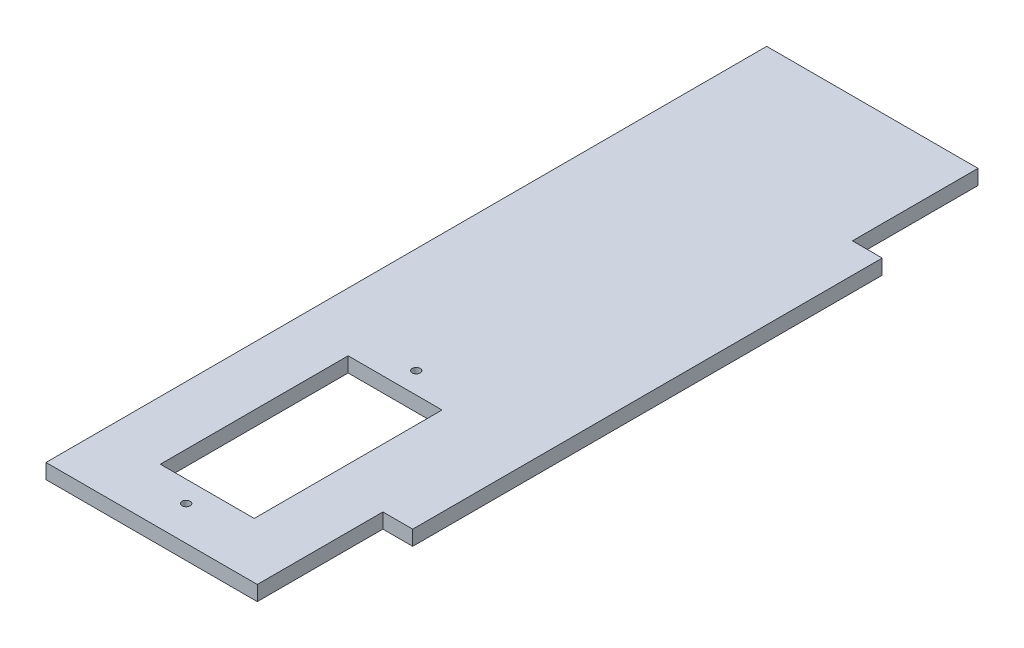
ISO-10303-21;
HEADER;
FILE_DESCRIPTION(('STEP AP214'),'2;1');
FILE_NAME('part.step','',(''),(''),'','','');
FILE_SCHEMA(('AUTOMOTIVE_DESIGN { 1 0 10303 214 1 1 1 1 }'));
ENDSEC;
DATA;
#1=APPLICATION_CONTEXT('core data for automotive mechanical design processes');
#2=APPLICATION_PROTOCOL_DEFINITION('international standard','automotive_design',2000,#1);
#3=PRODUCT_CONTEXT('',#1,'mechanical');
#4=PRODUCT('Part','Part','',(#3));
#5=PRODUCT_RELATED_PRODUCT_CATEGORY('part','',(#4));
#6=PRODUCT_DEFINITION_FORMATION('','',#4);
#7=PRODUCT_DEFINITION_CONTEXT('part definition',#1,'design');
#8=PRODUCT_DEFINITION('design','',#6,#7);
#9=PRODUCT_DEFINITION_SHAPE('','',#8);
#10=(LENGTH_UNIT() NAMED_UNIT(*) SI_UNIT(.MILLI.,.METRE.));
#11=(NAMED_UNIT(*) PLANE_ANGLE_UNIT() SI_UNIT($,.RADIAN.));
#12=(NAMED_UNIT(*) SI_UNIT($,.STERADIAN.) SOLID_ANGLE_UNIT());
#13=UNCERTAINTY_MEASURE_WITH_UNIT(LENGTH_MEASURE(1.E-05),#10,'distance_accuracy_value','');
#14=(GEOMETRIC_REPRESENTATION_CONTEXT(3) GLOBAL_UNCERTAINTY_ASSIGNED_CONTEXT((#13)) GLOBAL_UNIT_ASSIGNED_CONTEXT((#10,
#11,#12)) REPRESENTATION_CONTEXT('',''));
#15=CARTESIAN_POINT('',(0.,0.,0.));
#16=DIRECTION('',(0.,0.,1.));
#17=DIRECTION('',(1.,0.,0.));
#18=AXIS2_PLACEMENT_3D('',#15,#16,#17);
#19=CARTESIAN_POINT('',(-22.5,3.175,0.));
#20=DIRECTION('',(-1.,0.,0.));
#21=DIRECTION('',(0.,0.,1.));
#22=AXIS2_PLACEMENT_3D('',#19,#20,#21);
#23=PLANE('',#22);
#24=DIRECTION('',(0.,0.,-1.));
#25=VECTOR('',#24,1.);
#26=CARTESIAN_POINT('',(-22.5,0.,0.));
#27=LINE('',#26,#25);
#28=CARTESIAN_POINT('',(-22.5,0.,126.75));
#29=VERTEX_POINT('',#28);
#30=CARTESIAN_POINT('',(-22.5,0.,-26.75));
#31=VERTEX_POINT('',#30);
#32=EDGE_CURVE('E158',#29,#31,#27,.T.);
#33=ORIENTED_EDGE('',*,*,#32,.F.);
#34=DIRECTION('',(0.,-1.,0.));
#35=VECTOR('',#34,1.);
#36=CARTESIAN_POINT('',(-22.5,3.175,126.75));
#37=LINE('',#36,#35);
#38=CARTESIAN_POINT('',(-22.5,3.175,126.75));
#39=VERTEX_POINT('',#38);
#40=EDGE_CURVE('E11',#39,#29,#37,.T.);
#41=ORIENTED_EDGE('',*,*,#40,.F.);
#42=DIRECTION('',(0.,0.,-1.));
#43=VECTOR('',#42,1.);
#44=CARTESIAN_POINT('',(-22.5,3.175,0.));
#45=LINE('',#44,#43);
#46=CARTESIAN_POINT('',(-22.5,3.175,-26.75));
#47=VERTEX_POINT('',#46);
#48=EDGE_CURVE('E162',#39,#47,#45,.T.);
#49=ORIENTED_EDGE('',*,*,#48,.T.);
#50=DIRECTION('',(0.,-1.,0.));
#51=VECTOR('',#50,1.);
#52=CARTESIAN_POINT('',(-22.5,3.175,-26.75));
#53=LINE('',#52,#51);
#54=EDGE_CURVE('E187',#47,#31,#53,.T.);
#55=ORIENTED_EDGE('',*,*,#54,.T.);
#56=EDGE_LOOP('',(#33,#41,#49,#55));
#57=FACE_BOUND('',#56,.T.);
#58=ADVANCED_FACE('F35',(#57),#23,.T.);
#59=CARTESIAN_POINT('',(0.,3.175,126.75));
#60=DIRECTION('',(0.,0.,1.));
#61=DIRECTION('',(1.,0.,0.));
#62=AXIS2_PLACEMENT_3D('',#59,#60,#61);
#63=PLANE('',#62);
#64=DIRECTION('',(-1.,0.,0.));
#65=VECTOR('',#64,1.);
#66=CARTESIAN_POINT('',(0.,0.,126.75));
#67=LINE('',#66,#65);
#68=CARTESIAN_POINT('',(22.5,0.,126.75));
#69=VERTEX_POINT('',#68);
#70=EDGE_CURVE('E190',#69,#29,#67,.T.);
#71=ORIENTED_EDGE('',*,*,#70,.F.);
#72=DIRECTION('',(0.,-1.,0.));
#73=VECTOR('',#72,1.);
#74=CARTESIAN_POINT('',(22.5,3.175,126.75));
#75=LINE('',#74,#73);
#76=CARTESIAN_POINT('',(22.5,3.175,126.75));
#77=VERTEX_POINT('',#76);
#78=EDGE_CURVE('E42',#77,#69,#75,.T.);
#79=ORIENTED_EDGE('',*,*,#78,.F.);
#80=DIRECTION('',(-1.,0.,0.));
#81=VECTOR('',#80,1.);
#82=CARTESIAN_POINT('',(0.,3.175,126.75));
#83=LINE('',#82,#81);
#84=EDGE_CURVE('E165',#77,#39,#83,.T.);
#85=ORIENTED_EDGE('',*,*,#84,.T.);
#86=ORIENTED_EDGE('',*,*,#40,.T.);
#87=EDGE_LOOP('',(#71,#79,#85,#86));
#88=FACE_BOUND('',#87,.T.);
#89=ADVANCED_FACE('F227',(#88),#63,.T.);
#90=CARTESIAN_POINT('',(22.5,3.175,0.));
#91=DIRECTION('',(1.,0.,0.));
#92=DIRECTION('',(0.,0.,-1.));
#93=AXIS2_PLACEMENT_3D('',#90,#91,#92);
#94=PLANE('',#93);
#95=DIRECTION('',(0.,0.,1.));
#96=VECTOR('',#95,1.);
#97=CARTESIAN_POINT('',(22.5,0.,0.));
#98=LINE('',#97,#96);
#99=CARTESIAN_POINT('',(22.5,0.,100.));
#100=VERTEX_POINT('',#99);
#101=EDGE_CURVE('E193',#100,#69,#98,.T.);
#102=ORIENTED_EDGE('',*,*,#101,.F.);
#103=DIRECTION('',(0.,-1.,0.));
#104=VECTOR('',#103,1.);
#105=CARTESIAN_POINT('',(22.5,3.175,100.));
#106=LINE('',#105,#104);
#107=CARTESIAN_POINT('',(22.5,3.175,100.));
#108=VERTEX_POINT('',#107);
#109=EDGE_CURVE('E219',#108,#100,#106,.T.);
#110=ORIENTED_EDGE('',*,*,#109,.F.);
#111=DIRECTION('',(0.,0.,1.));
#112=VECTOR('',#111,1.);
#113=CARTESIAN_POINT('',(22.5,3.175,0.));
#114=LINE('',#113,#112);
#115=EDGE_CURVE('E169',#108,#77,#114,.T.);
#116=ORIENTED_EDGE('',*,*,#115,.T.);
#117=ORIENTED_EDGE('',*,*,#78,.T.);
#118=EDGE_LOOP('',(#102,#110,#116,#117));
#119=FACE_BOUND('',#118,.T.);
#120=ADVANCED_FACE('F223',(#119),#94,.T.);
#121=CARTESIAN_POINT('',(0.,3.175,100.));
#122=DIRECTION('',(0.,0.,1.));
#123=DIRECTION('',(1.,0.,0.));
#124=AXIS2_PLACEMENT_3D('',#121,#122,#123);
#125=PLANE('',#124);
#126=DIRECTION('',(-1.,0.,0.));
#127=VECTOR('',#126,1.);
#128=CARTESIAN_POINT('',(0.,0.,100.));
#129=LINE('',#128,#127);
#130=CARTESIAN_POINT('',(28.85,0.,100.));
#131=VERTEX_POINT('',#130);
#132=EDGE_CURVE('E196',#131,#100,#129,.T.);
#133=ORIENTED_EDGE('',*,*,#132,.F.);
#134=DIRECTION('',(0.,-1.,0.));
#135=VECTOR('',#134,1.);
#136=CARTESIAN_POINT('',(28.85,3.175,100.));
#137=LINE('',#136,#135);
#138=CARTESIAN_POINT('',(28.85,3.175,100.));
#139=VERTEX_POINT('',#138);
#140=EDGE_CURVE('E217',#139,#131,#137,.T.);
#141=ORIENTED_EDGE('',*,*,#140,.F.);
#142=DIRECTION('',(-1.,0.,0.));
#143=VECTOR('',#142,1.);
#144=CARTESIAN_POINT('',(0.,3.175,100.));
#145=LINE('',#144,#143);
#146=EDGE_CURVE('E172',#139,#108,#145,.T.);
#147=ORIENTED_EDGE('',*,*,#146,.T.);
#148=ORIENTED_EDGE('',*,*,#109,.T.);
#149=EDGE_LOOP('',(#133,#141,#147,#148));
#150=FACE_BOUND('',#149,.T.);
#151=ADVANCED_FACE('F232',(#150),#125,.T.);
#152=CARTESIAN_POINT('',(28.85,3.175,0.));
#153=DIRECTION('',(1.,0.,0.));
#154=DIRECTION('',(0.,0.,-1.));
#155=AXIS2_PLACEMENT_3D('',#152,#153,#154);
#156=PLANE('',#155);
#157=DIRECTION('',(0.,0.,1.));
#158=VECTOR('',#157,1.);
#159=CARTESIAN_POINT('',(28.85,0.,0.));
#160=LINE('',#159,#158);
#161=CARTESIAN_POINT('',(28.85,0.,0.));
#162=VERTEX_POINT('',#161);
#163=EDGE_CURVE('E199',#162,#131,#160,.T.);
#164=ORIENTED_EDGE('',*,*,#163,.F.);
#165=DIRECTION('',(0.,-1.,0.));
#166=VECTOR('',#165,1.);
#167=CARTESIAN_POINT('',(28.85,3.175,0.));
#168=LINE('',#167,#166);
#169=CARTESIAN_POINT('',(28.85,3.175,0.));
#170=VERTEX_POINT('',#169);
#171=EDGE_CURVE('E215',#170,#162,#168,.T.);
#172=ORIENTED_EDGE('',*,*,#171,.F.);
#173=DIRECTION('',(0.,0.,1.));
#174=VECTOR('',#173,1.);
#175=CARTESIAN_POINT('',(28.85,3.175,0.));
#176=LINE('',#175,#174);
#177=EDGE_CURVE('E175',#170,#139,#176,.T.);
#178=ORIENTED_EDGE('',*,*,#177,.T.);
#179=ORIENTED_EDGE('',*,*,#140,.T.);
#180=EDGE_LOOP('',(#164,#172,#178,#179));
#181=FACE_BOUND('',#180,.T.);
#182=ADVANCED_FACE('F252',(#181),#156,.T.);
#183=CARTESIAN_POINT('',(0.,3.175,0.));
#184=DIRECTION('',(0.,0.,-1.));
#185=DIRECTION('',(-1.,0.,0.));
#186=AXIS2_PLACEMENT_3D('',#183,#184,#185);
#187=PLANE('',#186);
#188=DIRECTION('',(1.,0.,0.));
#189=VECTOR('',#188,1.);
#190=CARTESIAN_POINT('',(0.,0.,0.));
#191=LINE('',#190,#189);
#192=CARTESIAN_POINT('',(22.5,0.,0.));
#193=VERTEX_POINT('',#192);
#194=EDGE_CURVE('E202',#193,#162,#191,.T.);
#195=ORIENTED_EDGE('',*,*,#194,.F.);
#196=DIRECTION('',(0.,-1.,0.));
#197=VECTOR('',#196,1.);
#198=CARTESIAN_POINT('',(22.5,3.175,0.));
#199=LINE('',#198,#197);
#200=CARTESIAN_POINT('',(22.5,3.175,0.));
#201=VERTEX_POINT('',#200);
#202=EDGE_CURVE('E213',#201,#193,#199,.T.);
#203=ORIENTED_EDGE('',*,*,#202,.F.);
#204=DIRECTION('',(1.,0.,0.));
#205=VECTOR('',#204,1.);
#206=CARTESIAN_POINT('',(0.,3.175,0.));
#207=LINE('',#206,#205);
#208=EDGE_CURVE('E178',#201,#170,#207,.T.);
#209=ORIENTED_EDGE('',*,*,#208,.T.);
#210=ORIENTED_EDGE('',*,*,#171,.T.);
#211=EDGE_LOOP('',(#195,#203,#209,#210));
#212=FACE_BOUND('',#211,.T.);
#213=ADVANCED_FACE('F249',(#212),#187,.T.);
#214=CARTESIAN_POINT('',(22.5,3.175,0.));
#215=DIRECTION('',(1.,0.,0.));
#216=DIRECTION('',(0.,0.,-1.));
#217=AXIS2_PLACEMENT_3D('',#214,#215,#216);
#218=PLANE('',#217);
#219=DIRECTION('',(0.,0.,1.));
#220=VECTOR('',#219,1.);
#221=CARTESIAN_POINT('',(22.5,0.,0.));
#222=LINE('',#221,#220);
#223=CARTESIAN_POINT('',(22.5,0.,-26.75));
#224=VERTEX_POINT('',#223);
#225=EDGE_CURVE('E205',#224,#193,#222,.T.);
#226=ORIENTED_EDGE('',*,*,#225,.F.);
#227=DIRECTION('',(0.,-1.,0.));
#228=VECTOR('',#227,1.);
#229=CARTESIAN_POINT('',(22.5,3.175,-26.75));
#230=LINE('',#229,#228);
#231=CARTESIAN_POINT('',(22.5,3.175,-26.75));
#232=VERTEX_POINT('',#231);
#233=EDGE_CURVE('E211',#232,#224,#230,.T.);
#234=ORIENTED_EDGE('',*,*,#233,.F.);
#235=DIRECTION('',(0.,0.,1.));
#236=VECTOR('',#235,1.);
#237=CARTESIAN_POINT('',(22.5,3.175,0.));
#238=LINE('',#237,#236);
#239=EDGE_CURVE('E181',#232,#201,#238,.T.);
#240=ORIENTED_EDGE('',*,*,#239,.T.);
#241=ORIENTED_EDGE('',*,*,#202,.T.);
#242=EDGE_LOOP('',(#226,#234,#240,#241));
#243=FACE_BOUND('',#242,.T.);
#244=ADVANCED_FACE('F246',(#243),#218,.T.);
#245=CARTESIAN_POINT('',(0.,3.175,-26.75));
#246=DIRECTION('',(0.,0.,-1.));
#247=DIRECTION('',(-1.,0.,0.));
#248=AXIS2_PLACEMENT_3D('',#245,#246,#247);
#249=PLANE('',#248);
#250=DIRECTION('',(1.,0.,0.));
#251=VECTOR('',#250,1.);
#252=CARTESIAN_POINT('',(0.,0.,-26.75));
#253=LINE('',#252,#251);
#254=EDGE_CURVE('E166',#31,#224,#253,.T.);
#255=ORIENTED_EDGE('',*,*,#254,.F.);
#256=ORIENTED_EDGE('',*,*,#54,.F.);
#257=DIRECTION('',(1.,0.,0.));
#258=VECTOR('',#257,1.);
#259=CARTESIAN_POINT('',(0.,3.175,-26.75));
#260=LINE('',#259,#258);
#261=EDGE_CURVE('E184',#47,#232,#260,.T.);
#262=ORIENTED_EDGE('',*,*,#261,.T.);
#263=ORIENTED_EDGE('',*,*,#233,.T.);
#264=EDGE_LOOP('',(#255,#256,#262,#263));
#265=FACE_BOUND('',#264,.T.);
#266=ADVANCED_FACE('F243',(#265),#249,.T.);
#267=CARTESIAN_POINT('',(0.,3.175,0.));
#268=DIRECTION('',(0.,1.,0.));
#269=DIRECTION('',(0.,0.,1.));
#270=AXIS2_PLACEMENT_3D('',#267,#268,#269);
#271=PLANE('',#270);
#272=CARTESIAN_POINT('',(0.,3.175,70.4));
#273=DIRECTION('',(0.,1.,0.));
#274=DIRECTION('',(0.,0.,1.));
#275=AXIS2_PLACEMENT_3D('',#272,#273,#274);
#276=CIRCLE('',#275,0.849999999999988);
#277=CARTESIAN_POINT('',(0.,3.175,71.25));
#278=VERTEX_POINT('',#277);
#279=EDGE_CURVE('E384',#278,#278,#276,.T.);
#280=ORIENTED_EDGE('',*,*,#279,.F.);
#281=EDGE_LOOP('',(#280));
#282=FACE_BOUND('',#281,.T.);
#283=CARTESIAN_POINT('',(0.,3.175,119.4));
#284=DIRECTION('',(0.,1.,0.));
#285=DIRECTION('',(0.,0.,1.));
#286=AXIS2_PLACEMENT_3D('',#283,#284,#285);
#287=CIRCLE('',#286,0.849999999999988);
#288=CARTESIAN_POINT('',(0.,3.175,120.25));
#289=VERTEX_POINT('',#288);
#290=EDGE_CURVE('E386',#289,#289,#287,.T.);
#291=ORIENTED_EDGE('',*,*,#290,.F.);
#292=EDGE_LOOP('',(#291));
#293=FACE_BOUND('',#292,.T.);
#294=DIRECTION('',(0.,0.,1.));
#295=VECTOR('',#294,1.);
#296=CARTESIAN_POINT('',(-10.,3.175,114.9));
#297=LINE('',#296,#295);
#298=CARTESIAN_POINT('',(-10.,3.175,74.9));
#299=VERTEX_POINT('',#298);
#300=CARTESIAN_POINT('',(-10.,3.175,114.9));
#301=VERTEX_POINT('',#300);
#302=EDGE_CURVE('E49',#299,#301,#297,.T.);
#303=ORIENTED_EDGE('',*,*,#302,.F.);
#304=DIRECTION('',(-1.,0.,0.));
#305=VECTOR('',#304,1.);
#306=CARTESIAN_POINT('',(10.,3.175,74.9));
#307=LINE('',#306,#305);
#308=CARTESIAN_POINT('',(10.,3.175,74.9));
#309=VERTEX_POINT('',#308);
#310=EDGE_CURVE('E140',#309,#299,#307,.T.);
#311=ORIENTED_EDGE('',*,*,#310,.F.);
#312=DIRECTION('',(0.,0.,-1.));
#313=VECTOR('',#312,1.);
#314=CARTESIAN_POINT('',(10.,3.175,114.9));
#315=LINE('',#314,#313);
#316=CARTESIAN_POINT('',(10.,3.175,114.9));
#317=VERTEX_POINT('',#316);
#318=EDGE_CURVE('E143',#317,#309,#315,.T.);
#319=ORIENTED_EDGE('',*,*,#318,.F.);
#320=DIRECTION('',(1.,0.,0.));
#321=VECTOR('',#320,1.);
#322=CARTESIAN_POINT('',(10.,3.175,114.9));
#323=LINE('',#322,#321);
#324=EDGE_CURVE('E152',#301,#317,#323,.T.);
#325=ORIENTED_EDGE('',*,*,#324,.F.);
#326=EDGE_LOOP('',(#303,#311,#319,#325));
#327=FACE_BOUND('',#326,.T.);
#328=ORIENTED_EDGE('',*,*,#48,.F.);
#329=ORIENTED_EDGE('',*,*,#84,.F.);
#330=ORIENTED_EDGE('',*,*,#115,.F.);
#331=ORIENTED_EDGE('',*,*,#146,.F.);
#332=ORIENTED_EDGE('',*,*,#177,.F.);
#333=ORIENTED_EDGE('',*,*,#208,.F.);
#334=ORIENTED_EDGE('',*,*,#239,.F.);
#335=ORIENTED_EDGE('',*,*,#261,.F.);
#336=EDGE_LOOP('',(#328,#329,#330,#331,#332,#333,#334,#335));
#337=FACE_BOUND('',#336,.T.);
#338=ADVANCED_FACE('F236',(#282,#293,#327,#337),#271,.T.);
#339=CARTESIAN_POINT('',(0.,0.,0.));
#340=DIRECTION('',(0.,1.,0.));
#341=DIRECTION('',(0.,0.,1.));
#342=AXIS2_PLACEMENT_3D('',#339,#340,#341);
#343=PLANE('',#342);
#344=CARTESIAN_POINT('',(0.,0.,70.4));
#345=DIRECTION('',(0.,1.,0.));
#346=DIRECTION('',(0.,0.,1.));
#347=AXIS2_PLACEMENT_3D('',#344,#345,#346);
#348=CIRCLE('',#347,0.849999999999999);
#349=CARTESIAN_POINT('',(0.,0.,71.25));
#350=VERTEX_POINT('',#349);
#351=EDGE_CURVE('E381',#350,#350,#348,.T.);
#352=ORIENTED_EDGE('',*,*,#351,.T.);
#353=EDGE_LOOP('',(#352));
#354=FACE_BOUND('',#353,.T.);
#355=CARTESIAN_POINT('',(0.,0.,119.4));
#356=DIRECTION('',(0.,1.,0.));
#357=DIRECTION('',(0.,0.,1.));
#358=AXIS2_PLACEMENT_3D('',#355,#356,#357);
#359=CIRCLE('',#358,0.849999999999999);
#360=CARTESIAN_POINT('',(0.,0.,120.25));
#361=VERTEX_POINT('',#360);
#362=EDGE_CURVE('E146',#361,#361,#359,.T.);
#363=ORIENTED_EDGE('',*,*,#362,.T.);
#364=EDGE_LOOP('',(#363));
#365=FACE_BOUND('',#364,.T.);
#366=DIRECTION('',(-1.,0.,0.));
#367=VECTOR('',#366,1.);
#368=CARTESIAN_POINT('',(10.,0.,74.9));
#369=LINE('',#368,#367);
#370=CARTESIAN_POINT('',(10.,0.,74.9));
#371=VERTEX_POINT('',#370);
#372=CARTESIAN_POINT('',(-10.,0.,74.9));
#373=VERTEX_POINT('',#372);
#374=EDGE_CURVE('E130',#371,#373,#369,.T.);
#375=ORIENTED_EDGE('',*,*,#374,.T.);
#376=DIRECTION('',(0.,0.,1.));
#377=VECTOR('',#376,1.);
#378=CARTESIAN_POINT('',(-10.,0.,114.9));
#379=LINE('',#378,#377);
#380=CARTESIAN_POINT('',(-10.,0.,114.9));
#381=VERTEX_POINT('',#380);
#382=EDGE_CURVE('E124',#373,#381,#379,.T.);
#383=ORIENTED_EDGE('',*,*,#382,.T.);
#384=DIRECTION('',(1.,0.,0.));
#385=VECTOR('',#384,1.);
#386=CARTESIAN_POINT('',(10.,0.,114.9));
#387=LINE('',#386,#385);
#388=CARTESIAN_POINT('',(10.,0.,114.9));
#389=VERTEX_POINT('',#388);
#390=EDGE_CURVE('E133',#381,#389,#387,.T.);
#391=ORIENTED_EDGE('',*,*,#390,.T.);
#392=DIRECTION('',(0.,0.,-1.));
#393=VECTOR('',#392,1.);
#394=CARTESIAN_POINT('',(10.,0.,114.9));
#395=LINE('',#394,#393);
#396=EDGE_CURVE('E57',#389,#371,#395,.T.);
#397=ORIENTED_EDGE('',*,*,#396,.T.);
#398=EDGE_LOOP('',(#375,#383,#391,#397));
#399=FACE_BOUND('',#398,.T.);
#400=ORIENTED_EDGE('',*,*,#32,.T.);
#401=ORIENTED_EDGE('',*,*,#254,.T.);
#402=ORIENTED_EDGE('',*,*,#225,.T.);
#403=ORIENTED_EDGE('',*,*,#194,.T.);
#404=ORIENTED_EDGE('',*,*,#163,.T.);
#405=ORIENTED_EDGE('',*,*,#132,.T.);
#406=ORIENTED_EDGE('',*,*,#101,.T.);
#407=ORIENTED_EDGE('',*,*,#70,.T.);
#408=EDGE_LOOP('',(#400,#401,#402,#403,#404,#405,#406,#407));
#409=FACE_BOUND('',#408,.T.);
#410=ADVANCED_FACE('F137',(#354,#365,#399,#409),#343,.F.);
#411=CARTESIAN_POINT('',(-10.,0.,114.9));
#412=DIRECTION('',(-1.,0.,0.));
#413=DIRECTION('',(0.,0.,1.));
#414=AXIS2_PLACEMENT_3D('',#411,#412,#413);
#415=PLANE('',#414);
#416=ORIENTED_EDGE('',*,*,#302,.T.);
#417=DIRECTION('',(0.,1.,0.));
#418=VECTOR('',#417,1.);
#419=CARTESIAN_POINT('',(-10.,0.,114.9));
#420=LINE('',#419,#418);
#421=EDGE_CURVE('E120',#381,#301,#420,.T.);
#422=ORIENTED_EDGE('',*,*,#421,.F.);
#423=ORIENTED_EDGE('',*,*,#382,.F.);
#424=DIRECTION('',(0.,1.,0.));
#425=VECTOR('',#424,1.);
#426=CARTESIAN_POINT('',(-10.,0.,74.9));
#427=LINE('',#426,#425);
#428=EDGE_CURVE('E156',#373,#299,#427,.T.);
#429=ORIENTED_EDGE('',*,*,#428,.T.);
#430=EDGE_LOOP('',(#416,#422,#423,#429));
#431=FACE_BOUND('',#430,.T.);
#432=ADVANCED_FACE('F122',(#431),#415,.F.);
#433=CARTESIAN_POINT('',(10.,0.,74.9));
#434=DIRECTION('',(0.,0.,-1.));
#435=DIRECTION('',(-1.,0.,0.));
#436=AXIS2_PLACEMENT_3D('',#433,#434,#435);
#437=PLANE('',#436);
#438=ORIENTED_EDGE('',*,*,#310,.T.);
#439=ORIENTED_EDGE('',*,*,#428,.F.);
#440=ORIENTED_EDGE('',*,*,#374,.F.);
#441=DIRECTION('',(0.,1.,0.));
#442=VECTOR('',#441,1.);
#443=CARTESIAN_POINT('',(10.,0.,74.9));
#444=LINE('',#443,#442);
#445=EDGE_CURVE('E159',#371,#309,#444,.T.);
#446=ORIENTED_EDGE('',*,*,#445,.T.);
#447=EDGE_LOOP('',(#438,#439,#440,#446));
#448=FACE_BOUND('',#447,.T.);
#449=ADVANCED_FACE('F312',(#448),#437,.F.);
#450=CARTESIAN_POINT('',(10.,0.,114.9));
#451=DIRECTION('',(1.,0.,0.));
#452=DIRECTION('',(0.,0.,-1.));
#453=AXIS2_PLACEMENT_3D('',#450,#451,#452);
#454=PLANE('',#453);
#455=ORIENTED_EDGE('',*,*,#318,.T.);
#456=ORIENTED_EDGE('',*,*,#445,.F.);
#457=ORIENTED_EDGE('',*,*,#396,.F.);
#458=DIRECTION('',(0.,1.,0.));
#459=VECTOR('',#458,1.);
#460=CARTESIAN_POINT('',(10.,0.,114.9));
#461=LINE('',#460,#459);
#462=EDGE_CURVE('E129',#389,#317,#461,.T.);
#463=ORIENTED_EDGE('',*,*,#462,.T.);
#464=EDGE_LOOP('',(#455,#456,#457,#463));
#465=FACE_BOUND('',#464,.T.);
#466=ADVANCED_FACE('F323',(#465),#454,.F.);
#467=CARTESIAN_POINT('',(10.,0.,114.9));
#468=DIRECTION('',(0.,0.,1.));
#469=DIRECTION('',(1.,0.,0.));
#470=AXIS2_PLACEMENT_3D('',#467,#468,#469);
#471=PLANE('',#470);
#472=ORIENTED_EDGE('',*,*,#324,.T.);
#473=ORIENTED_EDGE('',*,*,#462,.F.);
#474=ORIENTED_EDGE('',*,*,#390,.F.);
#475=ORIENTED_EDGE('',*,*,#421,.T.);
#476=EDGE_LOOP('',(#472,#473,#474,#475));
#477=FACE_BOUND('',#476,.T.);
#478=ADVANCED_FACE('F134',(#477),#471,.F.);
#479=CARTESIAN_POINT('',(0.,3.175,119.4));
#480=DIRECTION('',(0.,1.,0.));
#481=DIRECTION('',(0.,0.,1.));
#482=AXIS2_PLACEMENT_3D('',#479,#480,#481);
#483=CYLINDRICAL_SURFACE('',#482,0.849999999999993);
#484=ORIENTED_EDGE('',*,*,#362,.F.);
#485=EDGE_LOOP('',(#484));
#486=FACE_BOUND('',#485,.T.);
#487=ORIENTED_EDGE('',*,*,#290,.T.);
#488=EDGE_LOOP('',(#487));
#489=FACE_BOUND('',#488,.T.);
#490=ADVANCED_FACE('F341',(#486,#489),#483,.F.);
#491=CARTESIAN_POINT('',(0.,3.175,70.4));
#492=DIRECTION('',(0.,1.,0.));
#493=DIRECTION('',(0.,0.,1.));
#494=AXIS2_PLACEMENT_3D('',#491,#492,#493);
#495=CYLINDRICAL_SURFACE('',#494,0.849999999999993);
#496=ORIENTED_EDGE('',*,*,#351,.F.);
#497=EDGE_LOOP('',(#496));
#498=FACE_BOUND('',#497,.T.);
#499=ORIENTED_EDGE('',*,*,#279,.T.);
#500=EDGE_LOOP('',(#499));
#501=FACE_BOUND('',#500,.T.);
#502=ADVANCED_FACE('F364',(#498,#501),#495,.F.);
#503=CLOSED_SHELL('',(#58,#89,#120,#151,#182,#213,#244,#266,#338,#410,#432,#449,#466,#478,#490,#502));
#504=MANIFOLD_SOLID_BREP('B2',#503);
#505=ADVANCED_BREP_SHAPE_REPRESENTATION('',(#18,#504),#14);
#506=SHAPE_DEFINITION_REPRESENTATION(#9,#505);
ENDSEC;
END-ISO-10303-21;
